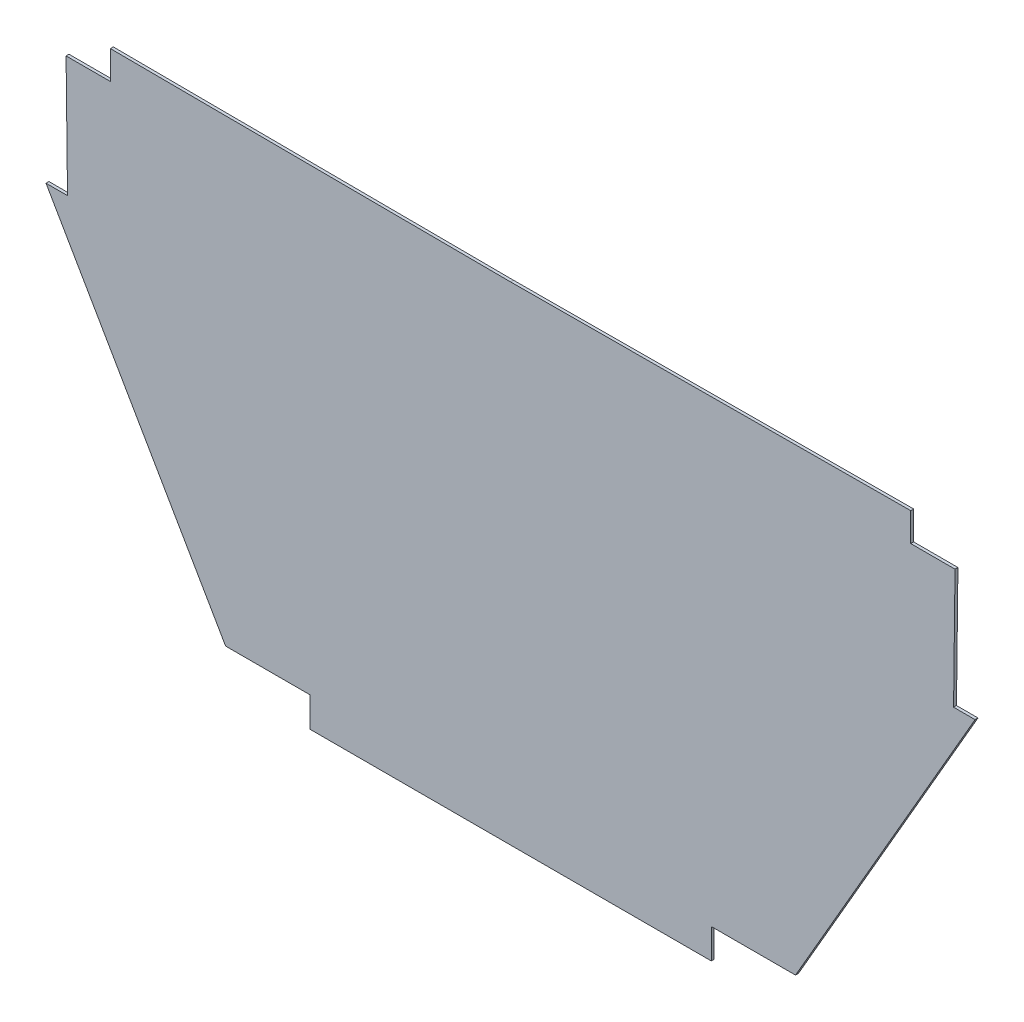
ISO-10303-21;
HEADER;
FILE_DESCRIPTION(('STEP AP214'),'2;1');
FILE_NAME('part.step','',(''),(''),'','','');
FILE_SCHEMA(('AUTOMOTIVE_DESIGN { 1 0 10303 214 1 1 1 1 }'));
ENDSEC;
DATA;
#1=APPLICATION_CONTEXT('core data for automotive mechanical design processes');
#2=APPLICATION_PROTOCOL_DEFINITION('international standard','automotive_design',2000,#1);
#3=PRODUCT_CONTEXT('',#1,'mechanical');
#4=PRODUCT('Part','Part','',(#3));
#5=PRODUCT_RELATED_PRODUCT_CATEGORY('part','',(#4));
#6=PRODUCT_DEFINITION_FORMATION('','',#4);
#7=PRODUCT_DEFINITION_CONTEXT('part definition',#1,'design');
#8=PRODUCT_DEFINITION('design','',#6,#7);
#9=PRODUCT_DEFINITION_SHAPE('','',#8);
#10=(LENGTH_UNIT() NAMED_UNIT(*) SI_UNIT(.MILLI.,.METRE.));
#11=(NAMED_UNIT(*) PLANE_ANGLE_UNIT() SI_UNIT($,.RADIAN.));
#12=(NAMED_UNIT(*) SI_UNIT($,.STERADIAN.) SOLID_ANGLE_UNIT());
#13=UNCERTAINTY_MEASURE_WITH_UNIT(LENGTH_MEASURE(1.E-05),#10,'distance_accuracy_value','');
#14=(GEOMETRIC_REPRESENTATION_CONTEXT(3) GLOBAL_UNCERTAINTY_ASSIGNED_CONTEXT((#13)) GLOBAL_UNIT_ASSIGNED_CONTEXT((#10,
#11,#12)) REPRESENTATION_CONTEXT('',''));
#15=CARTESIAN_POINT('',(0.,0.,0.));
#16=DIRECTION('',(0.,0.,1.));
#17=DIRECTION('',(1.,0.,0.));
#18=AXIS2_PLACEMENT_3D('',#15,#16,#17);
#19=CARTESIAN_POINT('',(780.693298387156,526.455448064361,2.));
#20=DIRECTION('',(1.,0.,0.));
#21=DIRECTION('',(0.,0.,-1.));
#22=AXIS2_PLACEMENT_3D('',#19,#20,#21);
#23=PLANE('',#22);
#24=DIRECTION('',(0.,-1.,0.));
#25=VECTOR('',#24,1.);
#26=CARTESIAN_POINT('',(780.693298387156,526.455448064361,0.));
#27=LINE('',#26,#25);
#28=CARTESIAN_POINT('',(780.693298387156,526.455448064361,0.));
#29=VERTEX_POINT('',#28);
#30=CARTESIAN_POINT('',(780.693298387156,506.846953045368,0.));
#31=VERTEX_POINT('',#30);
#32=EDGE_CURVE('E181',#29,#31,#27,.T.);
#33=ORIENTED_EDGE('',*,*,#32,.F.);
#34=DIRECTION('',(0.,0.,-1.));
#35=VECTOR('',#34,1.);
#36=CARTESIAN_POINT('',(780.693298387156,526.455448064361,2.));
#37=LINE('',#36,#35);
#38=CARTESIAN_POINT('',(780.693298387156,526.455448064361,2.));
#39=VERTEX_POINT('',#38);
#40=EDGE_CURVE('E11',#39,#29,#37,.T.);
#41=ORIENTED_EDGE('',*,*,#40,.F.);
#42=DIRECTION('',(0.,-1.,0.));
#43=VECTOR('',#42,1.);
#44=CARTESIAN_POINT('',(780.693298387156,526.455448064361,2.));
#45=LINE('',#44,#43);
#46=CARTESIAN_POINT('',(780.693298387156,506.846953045368,2.));
#47=VERTEX_POINT('',#46);
#48=EDGE_CURVE('E221',#39,#47,#45,.T.);
#49=ORIENTED_EDGE('',*,*,#48,.T.);
#50=DIRECTION('',(0.,0.,-1.));
#51=VECTOR('',#50,1.);
#52=CARTESIAN_POINT('',(780.693298387156,506.846953045368,2.));
#53=LINE('',#52,#51);
#54=EDGE_CURVE('E35',#47,#31,#53,.T.);
#55=ORIENTED_EDGE('',*,*,#54,.T.);
#56=EDGE_LOOP('',(#33,#41,#49,#55));
#57=FACE_BOUND('',#56,.T.);
#58=ADVANCED_FACE('F32',(#57),#23,.T.);
#59=CARTESIAN_POINT('',(780.693298387156,526.455448064361,2.));
#60=DIRECTION('',(0.00497158499545859,-0.999987641594951,0.));
#61=DIRECTION('',(0.999987641594952,0.00497158499545859,0.));
#62=AXIS2_PLACEMENT_3D('',#59,#60,#61);
#63=PLANE('',#62);
#64=DIRECTION('',(-0.999987641594951,-0.00497158499545859,0.));
#65=VECTOR('',#64,1.);
#66=CARTESIAN_POINT('',(780.693298387156,526.455448064361,0.));
#67=LINE('',#66,#65);
#68=CARTESIAN_POINT('',(505.404886444168,525.086811411955,0.));
#69=VERTEX_POINT('',#68);
#70=EDGE_CURVE('E220',#29,#69,#67,.T.);
#71=ORIENTED_EDGE('',*,*,#70,.T.);
#72=DIRECTION('',(0.,0.,-1.));
#73=VECTOR('',#72,1.);
#74=CARTESIAN_POINT('',(505.404886444168,525.086811411955,2.));
#75=LINE('',#74,#73);
#76=CARTESIAN_POINT('',(505.404886444168,525.086811411955,2.));
#77=VERTEX_POINT('',#76);
#78=EDGE_CURVE('E41',#77,#69,#75,.T.);
#79=ORIENTED_EDGE('',*,*,#78,.F.);
#80=DIRECTION('',(-0.999987641594951,-0.00497158499545859,0.));
#81=VECTOR('',#80,1.);
#82=CARTESIAN_POINT('',(780.693298387156,526.455448064361,2.));
#83=LINE('',#82,#81);
#84=EDGE_CURVE('E176',#39,#77,#83,.T.);
#85=ORIENTED_EDGE('',*,*,#84,.F.);
#86=ORIENTED_EDGE('',*,*,#40,.T.);
#87=EDGE_LOOP('',(#71,#79,#85,#86));
#88=FACE_BOUND('',#87,.T.);
#89=ADVANCED_FACE('F257',(#88),#63,.F.);
#90=CARTESIAN_POINT('',(230.11647450118,526.455448064361,2.));
#91=DIRECTION('',(0.0049715849954594,0.999987641594951,0.));
#92=DIRECTION('',(-0.999987641594952,0.0049715849954594,0.));
#93=AXIS2_PLACEMENT_3D('',#90,#91,#92);
#94=PLANE('',#93);
#95=DIRECTION('',(0.999987641594951,-0.0049715849954594,0.));
#96=VECTOR('',#95,1.);
#97=CARTESIAN_POINT('',(230.11647450118,526.455448064361,0.));
#98=LINE('',#97,#96);
#99=CARTESIAN_POINT('',(230.11647450118,526.455448064361,0.));
#100=VERTEX_POINT('',#99);
#101=EDGE_CURVE('E161',#100,#69,#98,.T.);
#102=ORIENTED_EDGE('',*,*,#101,.F.);
#103=DIRECTION('',(0.,0.,-1.));
#104=VECTOR('',#103,1.);
#105=CARTESIAN_POINT('',(230.11647450118,526.455448064361,2.));
#106=LINE('',#105,#104);
#107=CARTESIAN_POINT('',(230.11647450118,526.455448064361,2.));
#108=VERTEX_POINT('',#107);
#109=EDGE_CURVE('E155',#108,#100,#106,.T.);
#110=ORIENTED_EDGE('',*,*,#109,.F.);
#111=DIRECTION('',(0.999987641594951,-0.0049715849954594,0.));
#112=VECTOR('',#111,1.);
#113=CARTESIAN_POINT('',(230.11647450118,526.455448064361,2.));
#114=LINE('',#113,#112);
#115=EDGE_CURVE('E159',#108,#77,#114,.T.);
#116=ORIENTED_EDGE('',*,*,#115,.T.);
#117=ORIENTED_EDGE('',*,*,#78,.T.);
#118=EDGE_LOOP('',(#102,#110,#116,#117));
#119=FACE_BOUND('',#118,.T.);
#120=ADVANCED_FACE('F157',(#119),#94,.T.);
#121=CARTESIAN_POINT('',(230.11647450118,526.455448064361,2.));
#122=DIRECTION('',(1.,0.,0.));
#123=DIRECTION('',(0.,0.,-1.));
#124=AXIS2_PLACEMENT_3D('',#121,#122,#123);
#125=PLANE('',#124);
#126=DIRECTION('',(0.,-1.,0.));
#127=VECTOR('',#126,1.);
#128=CARTESIAN_POINT('',(230.11647450118,526.455448064361,0.));
#129=LINE('',#128,#127);
#130=CARTESIAN_POINT('',(230.11647450118,506.846953045368,0.));
#131=VERTEX_POINT('',#130);
#132=EDGE_CURVE('E217',#100,#131,#129,.T.);
#133=ORIENTED_EDGE('',*,*,#132,.T.);
#134=DIRECTION('',(0.,0.,-1.));
#135=VECTOR('',#134,1.);
#136=CARTESIAN_POINT('',(230.11647450118,506.846953045368,2.));
#137=LINE('',#136,#135);
#138=CARTESIAN_POINT('',(230.11647450118,506.846953045368,2.));
#139=VERTEX_POINT('',#138);
#140=EDGE_CURVE('E164',#139,#131,#137,.T.);
#141=ORIENTED_EDGE('',*,*,#140,.F.);
#142=DIRECTION('',(0.,-1.,0.));
#143=VECTOR('',#142,1.);
#144=CARTESIAN_POINT('',(230.11647450118,526.455448064361,2.));
#145=LINE('',#144,#143);
#146=EDGE_CURVE('E167',#108,#139,#145,.T.);
#147=ORIENTED_EDGE('',*,*,#146,.F.);
#148=ORIENTED_EDGE('',*,*,#109,.T.);
#149=EDGE_LOOP('',(#133,#141,#147,#148));
#150=FACE_BOUND('',#149,.T.);
#151=ADVANCED_FACE('F168',(#150),#125,.F.);
#152=CARTESIAN_POINT('',(230.11647450118,506.846953045368,2.));
#153=DIRECTION('',(0.,-1.,0.));
#154=DIRECTION('',(0.,0.,-1.));
#155=AXIS2_PLACEMENT_3D('',#152,#153,#154);
#156=PLANE('',#155);
#157=DIRECTION('',(-1.,0.,0.));
#158=VECTOR('',#157,1.);
#159=CARTESIAN_POINT('',(230.11647450118,506.846953045368,0.));
#160=LINE('',#159,#158);
#161=CARTESIAN_POINT('',(199.641678363185,506.846953045368,0.));
#162=VERTEX_POINT('',#161);
#163=EDGE_CURVE('E215',#131,#162,#160,.T.);
#164=ORIENTED_EDGE('',*,*,#163,.T.);
#165=DIRECTION('',(0.,0.,-1.));
#166=VECTOR('',#165,1.);
#167=CARTESIAN_POINT('',(199.641678363185,506.846953045368,2.));
#168=LINE('',#167,#166);
#169=CARTESIAN_POINT('',(199.641678363185,506.846953045368,2.));
#170=VERTEX_POINT('',#169);
#171=EDGE_CURVE('E225',#170,#162,#168,.T.);
#172=ORIENTED_EDGE('',*,*,#171,.F.);
#173=DIRECTION('',(-1.,0.,0.));
#174=VECTOR('',#173,1.);
#175=CARTESIAN_POINT('',(230.11647450118,506.846953045368,2.));
#176=LINE('',#175,#174);
#177=EDGE_CURVE('E172',#139,#170,#176,.T.);
#178=ORIENTED_EDGE('',*,*,#177,.F.);
#179=ORIENTED_EDGE('',*,*,#140,.T.);
#180=EDGE_LOOP('',(#164,#172,#178,#179));
#181=FACE_BOUND('',#180,.T.);
#182=ADVANCED_FACE('F293',(#181),#156,.F.);
#183=CARTESIAN_POINT('',(199.641678363185,506.846953045368,2.));
#184=DIRECTION('',(0.999928247676102,0.0119791276560777,0.));
#185=DIRECTION('',(-0.0119791276560777,0.999928247676102,0.));
#186=AXIS2_PLACEMENT_3D('',#183,#184,#185);
#187=PLANE('',#186);
#188=DIRECTION('',(0.0119791276560777,-0.999928247676102,0.));
#189=VECTOR('',#188,1.);
#190=CARTESIAN_POINT('',(199.641678363185,506.846953045368,0.));
#191=LINE('',#190,#189);
#192=CARTESIAN_POINT('',(200.633041838216,424.095322804956,0.));
#193=VERTEX_POINT('',#192);
#194=EDGE_CURVE('E213',#162,#193,#191,.T.);
#195=ORIENTED_EDGE('',*,*,#194,.T.);
#196=DIRECTION('',(0.,0.,-1.));
#197=VECTOR('',#196,1.);
#198=CARTESIAN_POINT('',(200.633041838216,424.095322804956,2.));
#199=LINE('',#198,#197);
#200=CARTESIAN_POINT('',(200.633041838216,424.095322804956,2.));
#201=VERTEX_POINT('',#200);
#202=EDGE_CURVE('E228',#201,#193,#199,.T.);
#203=ORIENTED_EDGE('',*,*,#202,.F.);
#204=DIRECTION('',(0.0119791276560777,-0.999928247676102,0.));
#205=VECTOR('',#204,1.);
#206=CARTESIAN_POINT('',(199.641678363185,506.846953045368,2.));
#207=LINE('',#206,#205);
#208=EDGE_CURVE('E288',#170,#201,#207,.T.);
#209=ORIENTED_EDGE('',*,*,#208,.F.);
#210=ORIENTED_EDGE('',*,*,#171,.T.);
#211=EDGE_LOOP('',(#195,#203,#209,#210));
#212=FACE_BOUND('',#211,.T.);
#213=ADVANCED_FACE('F297',(#212),#187,.F.);
#214=CARTESIAN_POINT('',(200.633041838216,424.095322804956,2.));
#215=DIRECTION('',(0.,-1.,0.));
#216=DIRECTION('',(0.,0.,-1.));
#217=AXIS2_PLACEMENT_3D('',#214,#215,#216);
#218=PLANE('',#217);
#219=DIRECTION('',(-1.,0.,0.));
#220=VECTOR('',#219,1.);
#221=CARTESIAN_POINT('',(200.633041838216,424.095322804956,0.));
#222=LINE('',#221,#220);
#223=CARTESIAN_POINT('',(185.831141677529,424.095322804956,0.));
#224=VERTEX_POINT('',#223);
#225=EDGE_CURVE('E211',#193,#224,#222,.T.);
#226=ORIENTED_EDGE('',*,*,#225,.T.);
#227=DIRECTION('',(0.,0.,-1.));
#228=VECTOR('',#227,1.);
#229=CARTESIAN_POINT('',(185.831141677529,424.095322804956,2.));
#230=LINE('',#229,#228);
#231=CARTESIAN_POINT('',(185.831141677529,424.095322804956,2.));
#232=VERTEX_POINT('',#231);
#233=EDGE_CURVE('E231',#232,#224,#230,.T.);
#234=ORIENTED_EDGE('',*,*,#233,.F.);
#235=DIRECTION('',(-1.,0.,0.));
#236=VECTOR('',#235,1.);
#237=CARTESIAN_POINT('',(200.633041838216,424.095322804956,2.));
#238=LINE('',#237,#236);
#239=EDGE_CURVE('E286',#201,#232,#238,.T.);
#240=ORIENTED_EDGE('',*,*,#239,.F.);
#241=ORIENTED_EDGE('',*,*,#202,.T.);
#242=EDGE_LOOP('',(#226,#234,#240,#241));
#243=FACE_BOUND('',#242,.T.);
#244=ADVANCED_FACE('F302',(#243),#218,.F.);
#245=CARTESIAN_POINT('',(185.831141677529,424.095322804956,2.));
#246=DIRECTION('',(0.866025403784438,0.500000000000001,0.));
#247=DIRECTION('',(-0.500000000000001,0.866025403784438,0.));
#248=AXIS2_PLACEMENT_3D('',#245,#246,#247);
#249=PLANE('',#248);
#250=DIRECTION('',(0.500000000000001,-0.866025403784438,0.));
#251=VECTOR('',#250,1.);
#252=CARTESIAN_POINT('',(185.831141677529,424.095322804956,0.));
#253=LINE('',#252,#251);
#254=CARTESIAN_POINT('',(309.377353742716,210.107006425373,0.));
#255=VERTEX_POINT('',#254);
#256=EDGE_CURVE('E209',#224,#255,#253,.T.);
#257=ORIENTED_EDGE('',*,*,#256,.T.);
#258=DIRECTION('',(0.,0.,-1.));
#259=VECTOR('',#258,1.);
#260=CARTESIAN_POINT('',(309.377353742716,210.107006425373,2.));
#261=LINE('',#260,#259);
#262=CARTESIAN_POINT('',(309.377353742716,210.107006425373,2.));
#263=VERTEX_POINT('',#262);
#264=EDGE_CURVE('E234',#263,#255,#261,.T.);
#265=ORIENTED_EDGE('',*,*,#264,.F.);
#266=DIRECTION('',(0.500000000000001,-0.866025403784438,0.));
#267=VECTOR('',#266,1.);
#268=CARTESIAN_POINT('',(185.831141677529,424.095322804956,2.));
#269=LINE('',#268,#267);
#270=EDGE_CURVE('E284',#232,#263,#269,.T.);
#271=ORIENTED_EDGE('',*,*,#270,.F.);
#272=ORIENTED_EDGE('',*,*,#233,.T.);
#273=EDGE_LOOP('',(#257,#265,#271,#272));
#274=FACE_BOUND('',#273,.T.);
#275=ADVANCED_FACE('F308',(#274),#249,.F.);
#276=CARTESIAN_POINT('',(309.377353742716,210.107006425373,2.));
#277=DIRECTION('',(0.,1.,0.));
#278=DIRECTION('',(0.,0.,1.));
#279=AXIS2_PLACEMENT_3D('',#276,#277,#278);
#280=PLANE('',#279);
#281=DIRECTION('',(1.,0.,0.));
#282=VECTOR('',#281,1.);
#283=CARTESIAN_POINT('',(309.377353742716,210.107006425373,0.));
#284=LINE('',#283,#282);
#285=CARTESIAN_POINT('',(367.294120100411,210.107006425373,0.));
#286=VERTEX_POINT('',#285);
#287=EDGE_CURVE('E207',#255,#286,#284,.T.);
#288=ORIENTED_EDGE('',*,*,#287,.T.);
#289=DIRECTION('',(0.,0.,-1.));
#290=VECTOR('',#289,1.);
#291=CARTESIAN_POINT('',(367.294120100411,210.107006425373,2.));
#292=LINE('',#291,#290);
#293=CARTESIAN_POINT('',(367.294120100411,210.107006425373,2.));
#294=VERTEX_POINT('',#293);
#295=EDGE_CURVE('E237',#294,#286,#292,.T.);
#296=ORIENTED_EDGE('',*,*,#295,.F.);
#297=DIRECTION('',(1.,0.,0.));
#298=VECTOR('',#297,1.);
#299=CARTESIAN_POINT('',(309.377353742716,210.107006425373,2.));
#300=LINE('',#299,#298);
#301=EDGE_CURVE('E282',#263,#294,#300,.T.);
#302=ORIENTED_EDGE('',*,*,#301,.F.);
#303=ORIENTED_EDGE('',*,*,#264,.T.);
#304=EDGE_LOOP('',(#288,#296,#302,#303));
#305=FACE_BOUND('',#304,.T.);
#306=ADVANCED_FACE('F312',(#305),#280,.F.);
#307=CARTESIAN_POINT('',(367.294120100411,210.107006425373,2.));
#308=DIRECTION('',(1.,0.,0.));
#309=DIRECTION('',(0.,0.,-1.));
#310=AXIS2_PLACEMENT_3D('',#307,#308,#309);
#311=PLANE('',#310);
#312=DIRECTION('',(0.,-1.,0.));
#313=VECTOR('',#312,1.);
#314=CARTESIAN_POINT('',(367.294120100411,210.107006425373,0.));
#315=LINE('',#314,#313);
#316=CARTESIAN_POINT('',(367.294120100411,189.577029056785,0.));
#317=VERTEX_POINT('',#316);
#318=EDGE_CURVE('E205',#286,#317,#315,.T.);
#319=ORIENTED_EDGE('',*,*,#318,.T.);
#320=DIRECTION('',(0.,0.,-1.));
#321=VECTOR('',#320,1.);
#322=CARTESIAN_POINT('',(367.294120100411,189.577029056785,2.));
#323=LINE('',#322,#321);
#324=CARTESIAN_POINT('',(367.294120100411,189.577029056785,2.));
#325=VERTEX_POINT('',#324);
#326=EDGE_CURVE('E240',#325,#317,#323,.T.);
#327=ORIENTED_EDGE('',*,*,#326,.F.);
#328=DIRECTION('',(0.,-1.,0.));
#329=VECTOR('',#328,1.);
#330=CARTESIAN_POINT('',(367.294120100411,210.107006425373,2.));
#331=LINE('',#330,#329);
#332=EDGE_CURVE('E280',#294,#325,#331,.T.);
#333=ORIENTED_EDGE('',*,*,#332,.F.);
#334=ORIENTED_EDGE('',*,*,#295,.T.);
#335=EDGE_LOOP('',(#319,#327,#333,#334));
#336=FACE_BOUND('',#335,.T.);
#337=ADVANCED_FACE('F317',(#336),#311,.F.);
#338=CARTESIAN_POINT('',(367.294120100411,189.577029056785,2.));
#339=DIRECTION('',(0.,1.,0.));
#340=DIRECTION('',(0.,0.,1.));
#341=AXIS2_PLACEMENT_3D('',#338,#339,#340);
#342=PLANE('',#341);
#343=DIRECTION('',(1.,0.,0.));
#344=VECTOR('',#343,1.);
#345=CARTESIAN_POINT('',(367.294120100411,189.577029056785,0.));
#346=LINE('',#345,#344);
#347=CARTESIAN_POINT('',(643.515652787926,189.577029056785,0.));
#348=VERTEX_POINT('',#347);
#349=EDGE_CURVE('E202',#317,#348,#346,.T.);
#350=ORIENTED_EDGE('',*,*,#349,.T.);
#351=DIRECTION('',(0.,0.,-1.));
#352=VECTOR('',#351,1.);
#353=CARTESIAN_POINT('',(643.515652787926,189.577029056785,2.));
#354=LINE('',#353,#352);
#355=CARTESIAN_POINT('',(643.515652787926,189.577029056785,2.));
#356=VERTEX_POINT('',#355);
#357=EDGE_CURVE('E243',#356,#348,#354,.T.);
#358=ORIENTED_EDGE('',*,*,#357,.F.);
#359=DIRECTION('',(1.,0.,0.));
#360=VECTOR('',#359,1.);
#361=CARTESIAN_POINT('',(367.294120100411,189.577029056785,2.));
#362=LINE('',#361,#360);
#363=EDGE_CURVE('E278',#325,#356,#362,.T.);
#364=ORIENTED_EDGE('',*,*,#363,.F.);
#365=ORIENTED_EDGE('',*,*,#326,.T.);
#366=EDGE_LOOP('',(#350,#358,#364,#365));
#367=FACE_BOUND('',#366,.T.);
#368=ADVANCED_FACE('F323',(#367),#342,.F.);
#369=CARTESIAN_POINT('',(643.515652787926,210.107006425373,2.));
#370=DIRECTION('',(1.,0.,0.));
#371=DIRECTION('',(0.,0.,-1.));
#372=AXIS2_PLACEMENT_3D('',#369,#370,#371);
#373=PLANE('',#372);
#374=DIRECTION('',(0.,-1.,0.));
#375=VECTOR('',#374,1.);
#376=CARTESIAN_POINT('',(643.515652787926,210.107006425373,0.));
#377=LINE('',#376,#375);
#378=CARTESIAN_POINT('',(643.515652787926,210.107006425373,0.));
#379=VERTEX_POINT('',#378);
#380=EDGE_CURVE('E199',#379,#348,#377,.T.);
#381=ORIENTED_EDGE('',*,*,#380,.F.);
#382=DIRECTION('',(0.,0.,-1.));
#383=VECTOR('',#382,1.);
#384=CARTESIAN_POINT('',(643.515652787926,210.107006425373,2.));
#385=LINE('',#384,#383);
#386=CARTESIAN_POINT('',(643.515652787926,210.107006425373,2.));
#387=VERTEX_POINT('',#386);
#388=EDGE_CURVE('E245',#387,#379,#385,.T.);
#389=ORIENTED_EDGE('',*,*,#388,.F.);
#390=DIRECTION('',(0.,-1.,0.));
#391=VECTOR('',#390,1.);
#392=CARTESIAN_POINT('',(643.515652787926,210.107006425373,2.));
#393=LINE('',#392,#391);
#394=EDGE_CURVE('E275',#387,#356,#393,.T.);
#395=ORIENTED_EDGE('',*,*,#394,.T.);
#396=ORIENTED_EDGE('',*,*,#357,.T.);
#397=EDGE_LOOP('',(#381,#389,#395,#396));
#398=FACE_BOUND('',#397,.T.);
#399=ADVANCED_FACE('F327',(#398),#373,.T.);
#400=CARTESIAN_POINT('',(701.43241914562,210.107006425373,2.));
#401=DIRECTION('',(0.,-1.,0.));
#402=DIRECTION('',(0.,0.,-1.));
#403=AXIS2_PLACEMENT_3D('',#400,#401,#402);
#404=PLANE('',#403);
#405=DIRECTION('',(-1.,0.,0.));
#406=VECTOR('',#405,1.);
#407=CARTESIAN_POINT('',(701.43241914562,210.107006425373,0.));
#408=LINE('',#407,#406);
#409=CARTESIAN_POINT('',(701.43241914562,210.107006425373,0.));
#410=VERTEX_POINT('',#409);
#411=EDGE_CURVE('E196',#410,#379,#408,.T.);
#412=ORIENTED_EDGE('',*,*,#411,.F.);
#413=DIRECTION('',(0.,0.,-1.));
#414=VECTOR('',#413,1.);
#415=CARTESIAN_POINT('',(701.43241914562,210.107006425373,2.));
#416=LINE('',#415,#414);
#417=CARTESIAN_POINT('',(701.43241914562,210.107006425373,2.));
#418=VERTEX_POINT('',#417);
#419=EDGE_CURVE('E247',#418,#410,#416,.T.);
#420=ORIENTED_EDGE('',*,*,#419,.F.);
#421=DIRECTION('',(-1.,0.,0.));
#422=VECTOR('',#421,1.);
#423=CARTESIAN_POINT('',(701.43241914562,210.107006425373,2.));
#424=LINE('',#423,#422);
#425=EDGE_CURVE('E272',#418,#387,#424,.T.);
#426=ORIENTED_EDGE('',*,*,#425,.T.);
#427=ORIENTED_EDGE('',*,*,#388,.T.);
#428=EDGE_LOOP('',(#412,#420,#426,#427));
#429=FACE_BOUND('',#428,.T.);
#430=ADVANCED_FACE('F330',(#429),#404,.T.);
#431=CARTESIAN_POINT('',(824.978631210808,424.095322804956,2.));
#432=DIRECTION('',(0.866025403784438,-0.500000000000001,0.));
#433=DIRECTION('',(0.500000000000001,0.866025403784438,0.));
#434=AXIS2_PLACEMENT_3D('',#431,#432,#433);
#435=PLANE('',#434);
#436=DIRECTION('',(-0.5,-0.866025403784438,0.));
#437=VECTOR('',#436,1.);
#438=CARTESIAN_POINT('',(824.978631210808,424.095322804956,0.));
#439=LINE('',#438,#437);
#440=CARTESIAN_POINT('',(824.978631210808,424.095322804956,0.));
#441=VERTEX_POINT('',#440);
#442=EDGE_CURVE('E193',#441,#410,#439,.T.);
#443=ORIENTED_EDGE('',*,*,#442,.F.);
#444=DIRECTION('',(0.,0.,-1.));
#445=VECTOR('',#444,1.);
#446=CARTESIAN_POINT('',(824.978631210808,424.095322804956,2.));
#447=LINE('',#446,#445);
#448=CARTESIAN_POINT('',(824.978631210808,424.095322804956,2.));
#449=VERTEX_POINT('',#448);
#450=EDGE_CURVE('E249',#449,#441,#447,.T.);
#451=ORIENTED_EDGE('',*,*,#450,.F.);
#452=DIRECTION('',(-0.5,-0.866025403784438,0.));
#453=VECTOR('',#452,1.);
#454=CARTESIAN_POINT('',(824.978631210808,424.095322804956,2.));
#455=LINE('',#454,#453);
#456=EDGE_CURVE('E269',#449,#418,#455,.T.);
#457=ORIENTED_EDGE('',*,*,#456,.T.);
#458=ORIENTED_EDGE('',*,*,#419,.T.);
#459=EDGE_LOOP('',(#443,#451,#457,#458));
#460=FACE_BOUND('',#459,.T.);
#461=ADVANCED_FACE('F335',(#460),#435,.T.);
#462=CARTESIAN_POINT('',(810.17673105012,424.095322804956,2.));
#463=DIRECTION('',(0.,1.,0.));
#464=DIRECTION('',(0.,0.,1.));
#465=AXIS2_PLACEMENT_3D('',#462,#463,#464);
#466=PLANE('',#465);
#467=DIRECTION('',(1.,0.,0.));
#468=VECTOR('',#467,1.);
#469=CARTESIAN_POINT('',(810.17673105012,424.095322804956,0.));
#470=LINE('',#469,#468);
#471=CARTESIAN_POINT('',(810.17673105012,424.095322804956,0.));
#472=VERTEX_POINT('',#471);
#473=EDGE_CURVE('E190',#472,#441,#470,.T.);
#474=ORIENTED_EDGE('',*,*,#473,.F.);
#475=DIRECTION('',(0.,0.,-1.));
#476=VECTOR('',#475,1.);
#477=CARTESIAN_POINT('',(810.17673105012,424.095322804956,2.));
#478=LINE('',#477,#476);
#479=CARTESIAN_POINT('',(810.17673105012,424.095322804956,2.));
#480=VERTEX_POINT('',#479);
#481=EDGE_CURVE('E251',#480,#472,#478,.T.);
#482=ORIENTED_EDGE('',*,*,#481,.F.);
#483=DIRECTION('',(1.,0.,0.));
#484=VECTOR('',#483,1.);
#485=CARTESIAN_POINT('',(810.17673105012,424.095322804956,2.));
#486=LINE('',#485,#484);
#487=EDGE_CURVE('E266',#480,#449,#486,.T.);
#488=ORIENTED_EDGE('',*,*,#487,.T.);
#489=ORIENTED_EDGE('',*,*,#450,.T.);
#490=EDGE_LOOP('',(#474,#482,#488,#489));
#491=FACE_BOUND('',#490,.T.);
#492=ADVANCED_FACE('F338',(#491),#466,.T.);
#493=CARTESIAN_POINT('',(811.168094525152,506.846953045368,2.));
#494=DIRECTION('',(0.999928247676102,-0.0119791276560776,0.));
#495=DIRECTION('',(0.0119791276560776,0.999928247676102,0.));
#496=AXIS2_PLACEMENT_3D('',#493,#494,#495);
#497=PLANE('',#496);
#498=DIRECTION('',(-0.0119791276560776,-0.999928247676102,0.));
#499=VECTOR('',#498,1.);
#500=CARTESIAN_POINT('',(811.168094525152,506.846953045368,0.));
#501=LINE('',#500,#499);
#502=CARTESIAN_POINT('',(811.168094525152,506.846953045368,0.));
#503=VERTEX_POINT('',#502);
#504=EDGE_CURVE('E187',#503,#472,#501,.T.);
#505=ORIENTED_EDGE('',*,*,#504,.F.);
#506=DIRECTION('',(0.,0.,-1.));
#507=VECTOR('',#506,1.);
#508=CARTESIAN_POINT('',(811.168094525152,506.846953045368,2.));
#509=LINE('',#508,#507);
#510=CARTESIAN_POINT('',(811.168094525152,506.846953045368,2.));
#511=VERTEX_POINT('',#510);
#512=EDGE_CURVE('E252',#511,#503,#509,.T.);
#513=ORIENTED_EDGE('',*,*,#512,.F.);
#514=DIRECTION('',(-0.0119791276560776,-0.999928247676102,0.));
#515=VECTOR('',#514,1.);
#516=CARTESIAN_POINT('',(811.168094525152,506.846953045368,2.));
#517=LINE('',#516,#515);
#518=EDGE_CURVE('E261',#511,#480,#517,.T.);
#519=ORIENTED_EDGE('',*,*,#518,.T.);
#520=ORIENTED_EDGE('',*,*,#481,.T.);
#521=EDGE_LOOP('',(#505,#513,#519,#520));
#522=FACE_BOUND('',#521,.T.);
#523=ADVANCED_FACE('F340',(#522),#497,.T.);
#524=CARTESIAN_POINT('',(780.693298387156,506.846953045368,2.));
#525=DIRECTION('',(0.,1.,0.));
#526=DIRECTION('',(0.,0.,1.));
#527=AXIS2_PLACEMENT_3D('',#524,#525,#526);
#528=PLANE('',#527);
#529=DIRECTION('',(1.,0.,0.));
#530=VECTOR('',#529,1.);
#531=CARTESIAN_POINT('',(780.693298387156,506.846953045368,0.));
#532=LINE('',#531,#530);
#533=EDGE_CURVE('E184',#31,#503,#532,.T.);
#534=ORIENTED_EDGE('',*,*,#533,.F.);
#535=ORIENTED_EDGE('',*,*,#54,.F.);
#536=DIRECTION('',(1.,0.,0.));
#537=VECTOR('',#536,1.);
#538=CARTESIAN_POINT('',(780.693298387156,506.846953045368,2.));
#539=LINE('',#538,#537);
#540=EDGE_CURVE('E259',#47,#511,#539,.T.);
#541=ORIENTED_EDGE('',*,*,#540,.T.);
#542=ORIENTED_EDGE('',*,*,#512,.T.);
#543=EDGE_LOOP('',(#534,#535,#541,#542));
#544=FACE_BOUND('',#543,.T.);
#545=ADVANCED_FACE('F254',(#544),#528,.T.);
#546=CARTESIAN_POINT('',(0.,0.,2.));
#547=DIRECTION('',(0.,0.,1.));
#548=DIRECTION('',(1.,0.,0.));
#549=AXIS2_PLACEMENT_3D('',#546,#547,#548);
#550=PLANE('',#549);
#551=ORIENTED_EDGE('',*,*,#48,.F.);
#552=ORIENTED_EDGE('',*,*,#84,.T.);
#553=ORIENTED_EDGE('',*,*,#115,.F.);
#554=ORIENTED_EDGE('',*,*,#146,.T.);
#555=ORIENTED_EDGE('',*,*,#177,.T.);
#556=ORIENTED_EDGE('',*,*,#208,.T.);
#557=ORIENTED_EDGE('',*,*,#239,.T.);
#558=ORIENTED_EDGE('',*,*,#270,.T.);
#559=ORIENTED_EDGE('',*,*,#301,.T.);
#560=ORIENTED_EDGE('',*,*,#332,.T.);
#561=ORIENTED_EDGE('',*,*,#363,.T.);
#562=ORIENTED_EDGE('',*,*,#394,.F.);
#563=ORIENTED_EDGE('',*,*,#425,.F.);
#564=ORIENTED_EDGE('',*,*,#456,.F.);
#565=ORIENTED_EDGE('',*,*,#487,.F.);
#566=ORIENTED_EDGE('',*,*,#518,.F.);
#567=ORIENTED_EDGE('',*,*,#540,.F.);
#568=EDGE_LOOP('',(#551,#552,#553,#554,#555,#556,#557,#558,#559,#560,#561,#562,#563,#564,#565,
#566,#567));
#569=FACE_BOUND('',#568,.T.);
#570=ADVANCED_FACE('F175',(#569),#550,.T.);
#571=CARTESIAN_POINT('',(0.,0.,0.));
#572=DIRECTION('',(0.,0.,1.));
#573=DIRECTION('',(1.,0.,0.));
#574=AXIS2_PLACEMENT_3D('',#571,#572,#573);
#575=PLANE('',#574);
#576=ORIENTED_EDGE('',*,*,#32,.T.);
#577=ORIENTED_EDGE('',*,*,#533,.T.);
#578=ORIENTED_EDGE('',*,*,#504,.T.);
#579=ORIENTED_EDGE('',*,*,#473,.T.);
#580=ORIENTED_EDGE('',*,*,#442,.T.);
#581=ORIENTED_EDGE('',*,*,#411,.T.);
#582=ORIENTED_EDGE('',*,*,#380,.T.);
#583=ORIENTED_EDGE('',*,*,#349,.F.);
#584=ORIENTED_EDGE('',*,*,#318,.F.);
#585=ORIENTED_EDGE('',*,*,#287,.F.);
#586=ORIENTED_EDGE('',*,*,#256,.F.);
#587=ORIENTED_EDGE('',*,*,#225,.F.);
#588=ORIENTED_EDGE('',*,*,#194,.F.);
#589=ORIENTED_EDGE('',*,*,#163,.F.);
#590=ORIENTED_EDGE('',*,*,#132,.F.);
#591=ORIENTED_EDGE('',*,*,#101,.T.);
#592=ORIENTED_EDGE('',*,*,#70,.F.);
#593=EDGE_LOOP('',(#576,#577,#578,#579,#580,#581,#582,#583,#584,#585,#586,#587,#588,#589,#590,
#591,#592));
#594=FACE_BOUND('',#593,.T.);
#595=ADVANCED_FACE('F256',(#594),#575,.F.);
#596=CLOSED_SHELL('',(#58,#89,#120,#151,#182,#213,#244,#275,#306,#337,#368,#399,#430,#461,#492,
#523,#545,#570,#595));
#597=MANIFOLD_SOLID_BREP('B2',#596);
#598=ADVANCED_BREP_SHAPE_REPRESENTATION('',(#18,#597),#14);
#599=SHAPE_DEFINITION_REPRESENTATION(#9,#598);
ENDSEC;
END-ISO-10303-21;
